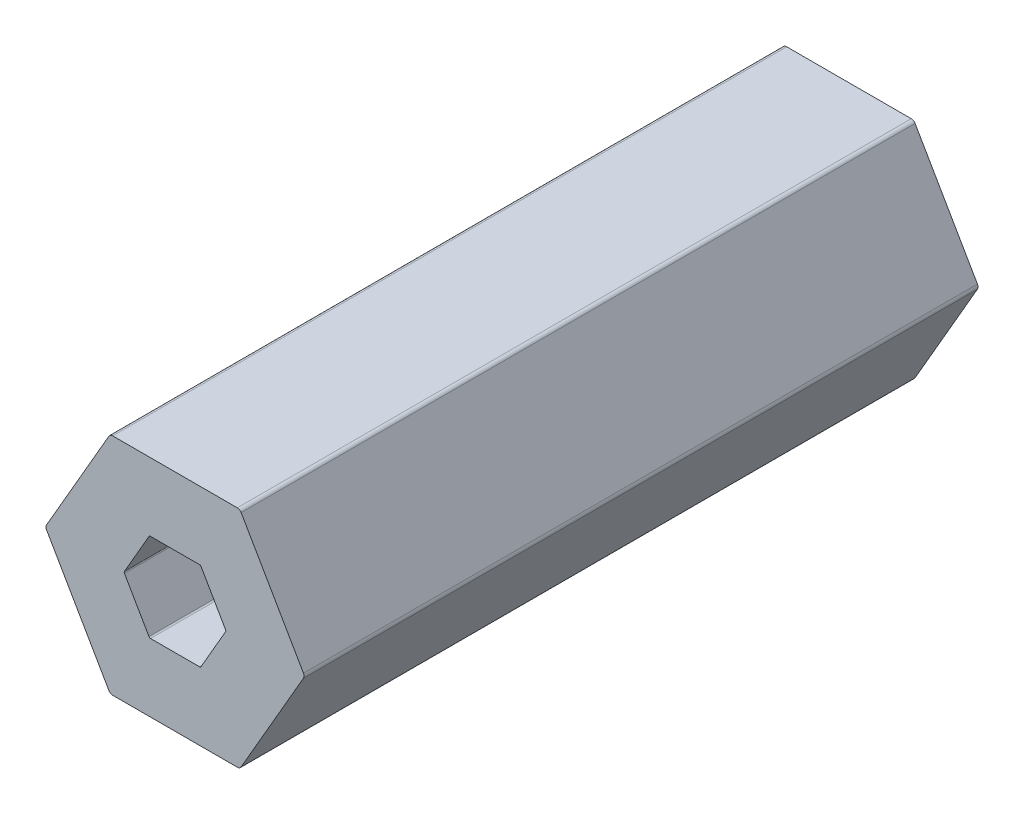
ISO-10303-21;
HEADER;
FILE_DESCRIPTION(('STEP AP214'),'2;1');
FILE_NAME('part.step','',(''),(''),'','','');
FILE_SCHEMA(('AUTOMOTIVE_DESIGN { 1 0 10303 214 1 1 1 1 }'));
ENDSEC;
DATA;
#1=APPLICATION_CONTEXT('core data for automotive mechanical design processes');
#2=APPLICATION_PROTOCOL_DEFINITION('international standard','automotive_design',2000,#1);
#3=PRODUCT_CONTEXT('',#1,'mechanical');
#4=PRODUCT('Part','Part','',(#3));
#5=PRODUCT_RELATED_PRODUCT_CATEGORY('part','',(#4));
#6=PRODUCT_DEFINITION_FORMATION('','',#4);
#7=PRODUCT_DEFINITION_CONTEXT('part definition',#1,'design');
#8=PRODUCT_DEFINITION('design','',#6,#7);
#9=PRODUCT_DEFINITION_SHAPE('','',#8);
#10=(LENGTH_UNIT() NAMED_UNIT(*) SI_UNIT(.MILLI.,.METRE.));
#11=(NAMED_UNIT(*) PLANE_ANGLE_UNIT() SI_UNIT($,.RADIAN.));
#12=(NAMED_UNIT(*) SI_UNIT($,.STERADIAN.) SOLID_ANGLE_UNIT());
#13=UNCERTAINTY_MEASURE_WITH_UNIT(LENGTH_MEASURE(1.E-05),#10,'distance_accuracy_value','');
#14=(GEOMETRIC_REPRESENTATION_CONTEXT(3) GLOBAL_UNCERTAINTY_ASSIGNED_CONTEXT((#13)) GLOBAL_UNIT_ASSIGNED_CONTEXT((#10,
#11,#12)) REPRESENTATION_CONTEXT('',''));
#15=CARTESIAN_POINT('',(0.,0.,0.));
#16=DIRECTION('',(0.,0.,1.));
#17=DIRECTION('',(1.,0.,0.));
#18=AXIS2_PLACEMENT_3D('',#15,#16,#17);
#19=CARTESIAN_POINT('',(2.77128129211021,0.,400.));
#20=DIRECTION('',(0.,0.,1.));
#21=DIRECTION('',(1.,0.,0.));
#22=AXIS2_PLACEMENT_3D('',#19,#20,#21);
#23=CYLINDRICAL_SURFACE('',#22,0.1);
#24=CARTESIAN_POINT('',(2.77128129211021,0.,38.1));
#25=DIRECTION('',(0.,0.,1.));
#26=DIRECTION('',(1.,0.,0.));
#27=AXIS2_PLACEMENT_3D('',#24,#25,#26);
#28=CIRCLE('',#27,0.1);
#29=CARTESIAN_POINT('',(2.85788383248865,0.0500000000000045,38.1));
#30=VERTEX_POINT('',#29);
#31=CARTESIAN_POINT('',(2.8712812921102,0.,38.1));
#32=VERTEX_POINT('',#31);
#33=EDGE_CURVE('E499',#30,#32,#28,.F.);
#34=ORIENTED_EDGE('',*,*,#33,.F.);
#35=DIRECTION('',(0.,0.,1.));
#36=VECTOR('',#35,1.);
#37=CARTESIAN_POINT('',(2.85788383248865,0.0500000000000085,400.));
#38=LINE('',#37,#36);
#39=CARTESIAN_POINT('',(2.85788383248865,0.0500000000000084,0.));
#40=VERTEX_POINT('',#39);
#41=EDGE_CURVE('E340',#40,#30,#38,.T.);
#42=ORIENTED_EDGE('',*,*,#41,.F.);
#43=CARTESIAN_POINT('',(2.77128129211021,0.,0.));
#44=DIRECTION('',(0.,0.,1.));
#45=DIRECTION('',(1.,0.,0.));
#46=AXIS2_PLACEMENT_3D('',#43,#44,#45);
#47=CIRCLE('',#46,0.1);
#48=CARTESIAN_POINT('',(2.8712812921102,0.,0.));
#49=VERTEX_POINT('',#48);
#50=EDGE_CURVE('E372',#49,#40,#47,.T.);
#51=ORIENTED_EDGE('',*,*,#50,.F.);
#52=DIRECTION('',(0.,0.,1.));
#53=VECTOR('',#52,1.);
#54=CARTESIAN_POINT('',(2.8712812921102,0.,400.));
#55=LINE('',#54,#53);
#56=EDGE_CURVE('E46',#49,#32,#55,.T.);
#57=ORIENTED_EDGE('',*,*,#56,.T.);
#58=EDGE_LOOP('',(#34,#42,#51,#57));
#59=FACE_BOUND('',#58,.T.);
#60=ADVANCED_FACE('F38',(#59),#23,.F.);
#61=CARTESIAN_POINT('',(-7.04367328411341,0.,400.));
#62=DIRECTION('',(0.,0.,-1.));
#63=DIRECTION('',(-1.,0.,0.));
#64=AXIS2_PLACEMENT_3D('',#61,#62,#63);
#65=CYLINDRICAL_SURFACE('',#64,0.25);
#66=DIRECTION('',(0.,0.,-1.));
#67=VECTOR('',#66,1.);
#68=CARTESIAN_POINT('',(-7.26017963505952,-0.125000000000051,400.));
#69=LINE('',#68,#67);
#70=CARTESIAN_POINT('',(-7.26017963505952,-0.12500000000005,38.1));
#71=VERTEX_POINT('',#70);
#72=CARTESIAN_POINT('',(-7.26017963505952,-0.12500000000005,0.));
#73=VERTEX_POINT('',#72);
#74=EDGE_CURVE('E396',#71,#73,#69,.T.);
#75=ORIENTED_EDGE('',*,*,#74,.F.);
#76=CARTESIAN_POINT('',(-7.04367328411341,0.,38.1));
#77=DIRECTION('',(0.,0.,1.));
#78=DIRECTION('',(1.,0.,0.));
#79=AXIS2_PLACEMENT_3D('',#76,#77,#78);
#80=CIRCLE('',#79,0.25);
#81=CARTESIAN_POINT('',(-7.29367328411341,0.,38.1));
#82=VERTEX_POINT('',#81);
#83=EDGE_CURVE('E453',#71,#82,#80,.F.);
#84=ORIENTED_EDGE('',*,*,#83,.T.);
#85=DIRECTION('',(0.,0.,-1.));
#86=VECTOR('',#85,1.);
#87=CARTESIAN_POINT('',(-7.29367328411341,0.,400.));
#88=LINE('',#87,#86);
#89=CARTESIAN_POINT('',(-7.29367328411341,0.,0.));
#90=VERTEX_POINT('',#89);
#91=EDGE_CURVE('E344',#82,#90,#88,.T.);
#92=ORIENTED_EDGE('',*,*,#91,.T.);
#93=CARTESIAN_POINT('',(-7.04367328411341,0.,0.));
#94=DIRECTION('',(0.,0.,-1.));
#95=DIRECTION('',(1.,0.,0.));
#96=AXIS2_PLACEMENT_3D('',#93,#94,#95);
#97=CIRCLE('',#96,0.25);
#98=EDGE_CURVE('E269',#73,#90,#97,.T.);
#99=ORIENTED_EDGE('',*,*,#98,.F.);
#100=EDGE_LOOP('',(#75,#84,#92,#99));
#101=FACE_BOUND('',#100,.T.);
#102=ADVANCED_FACE('F587',(#101),#65,.T.);
#103=CARTESIAN_POINT('',(3.66617420935418,-6.34999999999993,400.));
#104=DIRECTION('',(-0.866025403784442,0.5,0.));
#105=DIRECTION('',(0.,0.,1.));
#106=AXIS2_PLACEMENT_3D('',#103,#104,#105);
#107=PLANE('',#106);
#108=DIRECTION('',(0.499999999999999,0.866025403784439,0.));
#109=VECTOR('',#108,1.);
#110=CARTESIAN_POINT('',(3.66617420935418,-6.34999999999993,38.1));
#111=LINE('',#110,#109);
#112=CARTESIAN_POINT('',(3.73834299300289,-6.22499999999993,38.1));
#113=VERTEX_POINT('',#112);
#114=CARTESIAN_POINT('',(7.26017963505952,-0.125,38.1));
#115=VERTEX_POINT('',#114);
#116=EDGE_CURVE('E443',#113,#115,#111,.T.);
#117=ORIENTED_EDGE('',*,*,#116,.F.);
#118=DIRECTION('',(0.,0.,-1.));
#119=VECTOR('',#118,1.);
#120=CARTESIAN_POINT('',(3.73834299300288,-6.22499999999993,400.));
#121=LINE('',#120,#119);
#122=CARTESIAN_POINT('',(3.73834299300288,-6.22499999999993,0.));
#123=VERTEX_POINT('',#122);
#124=EDGE_CURVE('E302',#113,#123,#121,.T.);
#125=ORIENTED_EDGE('',*,*,#124,.T.);
#126=DIRECTION('',(0.5,0.866025403784442,0.));
#127=VECTOR('',#126,1.);
#128=CARTESIAN_POINT('',(3.66617420935418,-6.34999999999993,0.));
#129=LINE('',#128,#127);
#130=CARTESIAN_POINT('',(7.26017963505952,-0.125,0.));
#131=VERTEX_POINT('',#130);
#132=EDGE_CURVE('E304',#123,#131,#129,.T.);
#133=ORIENTED_EDGE('',*,*,#132,.T.);
#134=DIRECTION('',(0.,0.,1.));
#135=VECTOR('',#134,1.);
#136=CARTESIAN_POINT('',(7.26017963505952,-0.125,400.));
#137=LINE('',#136,#135);
#138=EDGE_CURVE('E392',#131,#115,#137,.T.);
#139=ORIENTED_EDGE('',*,*,#138,.T.);
#140=EDGE_LOOP('',(#117,#125,#133,#139));
#141=FACE_BOUND('',#140,.T.);
#142=ADVANCED_FACE('F537',(#141),#107,.F.);
#143=CARTESIAN_POINT('',(7.33234841870822,0.,400.));
#144=DIRECTION('',(-0.866025403784438,-0.5,0.));
#145=DIRECTION('',(-0.5,0.866025403784438,0.));
#146=AXIS2_PLACEMENT_3D('',#143,#144,#145);
#147=PLANE('',#146);
#148=DIRECTION('',(-0.5,0.866025403784438,0.));
#149=VECTOR('',#148,1.);
#150=CARTESIAN_POINT('',(7.33234841870822,0.,38.1));
#151=LINE('',#150,#149);
#152=CARTESIAN_POINT('',(7.26017963505952,0.125,38.1));
#153=VERTEX_POINT('',#152);
#154=CARTESIAN_POINT('',(3.7383429930028,6.225,38.1));
#155=VERTEX_POINT('',#154);
#156=EDGE_CURVE('E53',#153,#155,#151,.T.);
#157=ORIENTED_EDGE('',*,*,#156,.F.);
#158=DIRECTION('',(0.,0.,-1.));
#159=VECTOR('',#158,1.);
#160=CARTESIAN_POINT('',(7.26017963505952,0.125,400.));
#161=LINE('',#160,#159);
#162=CARTESIAN_POINT('',(7.26017963505952,0.125,0.));
#163=VERTEX_POINT('',#162);
#164=EDGE_CURVE('E319',#153,#163,#161,.T.);
#165=ORIENTED_EDGE('',*,*,#164,.T.);
#166=DIRECTION('',(-0.5,0.866025403784438,0.));
#167=VECTOR('',#166,1.);
#168=CARTESIAN_POINT('',(7.33234841870822,0.,0.));
#169=LINE('',#168,#167);
#170=CARTESIAN_POINT('',(3.7383429930028,6.225,0.));
#171=VERTEX_POINT('',#170);
#172=EDGE_CURVE('E316',#163,#171,#169,.T.);
#173=ORIENTED_EDGE('',*,*,#172,.T.);
#174=DIRECTION('',(0.,0.,1.));
#175=VECTOR('',#174,1.);
#176=CARTESIAN_POINT('',(3.7383429930028,6.225,400.));
#177=LINE('',#176,#175);
#178=EDGE_CURVE('E320',#171,#155,#177,.T.);
#179=ORIENTED_EDGE('',*,*,#178,.T.);
#180=EDGE_LOOP('',(#157,#165,#173,#179));
#181=FACE_BOUND('',#180,.T.);
#182=ADVANCED_FACE('F579',(#181),#147,.F.);
#183=CARTESIAN_POINT('',(3.6661742093541,6.35,400.));
#184=DIRECTION('',(0.,-1.,0.));
#185=DIRECTION('',(0.,0.,-1.));
#186=AXIS2_PLACEMENT_3D('',#183,#184,#185);
#187=PLANE('',#186);
#188=DIRECTION('',(-1.,0.,0.));
#189=VECTOR('',#188,1.);
#190=CARTESIAN_POINT('',(3.6661742093541,6.35,38.1));
#191=LINE('',#190,#189);
#192=CARTESIAN_POINT('',(3.52183664205669,6.35,38.1));
#193=VERTEX_POINT('',#192);
#194=CARTESIAN_POINT('',(-3.52183664205674,6.34999999999997,38.1));
#195=VERTEX_POINT('',#194);
#196=EDGE_CURVE('E427',#193,#195,#191,.T.);
#197=ORIENTED_EDGE('',*,*,#196,.F.);
#198=DIRECTION('',(0.,0.,-1.));
#199=VECTOR('',#198,1.);
#200=CARTESIAN_POINT('',(3.52183664205669,6.35,400.));
#201=LINE('',#200,#199);
#202=CARTESIAN_POINT('',(3.52183664205669,6.35,0.));
#203=VERTEX_POINT('',#202);
#204=EDGE_CURVE('E351',#193,#203,#201,.T.);
#205=ORIENTED_EDGE('',*,*,#204,.T.);
#206=DIRECTION('',(-1.,0.,0.));
#207=VECTOR('',#206,1.);
#208=CARTESIAN_POINT('',(3.6661742093541,6.35,0.));
#209=LINE('',#208,#207);
#210=CARTESIAN_POINT('',(-3.52183664205673,6.35,0.));
#211=VERTEX_POINT('',#210);
#212=EDGE_CURVE('E355',#203,#211,#209,.T.);
#213=ORIENTED_EDGE('',*,*,#212,.T.);
#214=DIRECTION('',(0.,0.,1.));
#215=VECTOR('',#214,1.);
#216=CARTESIAN_POINT('',(-3.52183664205673,6.35,400.));
#217=LINE('',#216,#215);
#218=EDGE_CURVE('E358',#211,#195,#217,.T.);
#219=ORIENTED_EDGE('',*,*,#218,.T.);
#220=EDGE_LOOP('',(#197,#205,#213,#219));
#221=FACE_BOUND('',#220,.T.);
#222=ADVANCED_FACE('F572',(#221),#187,.F.);
#223=CARTESIAN_POINT('',(-3.66617420935414,6.35,400.));
#224=DIRECTION('',(0.866025403784442,-0.5,0.));
#225=DIRECTION('',(0.,0.,-1.));
#226=AXIS2_PLACEMENT_3D('',#223,#224,#225);
#227=PLANE('',#226);
#228=DIRECTION('',(-0.499999999999999,-0.866025403784439,0.));
#229=VECTOR('',#228,1.);
#230=CARTESIAN_POINT('',(-3.66617420935414,6.35,38.1));
#231=LINE('',#230,#229);
#232=CARTESIAN_POINT('',(-3.73834299300284,6.225,38.1));
#233=VERTEX_POINT('',#232);
#234=CARTESIAN_POINT('',(-7.26017963505957,0.124999999999951,38.1));
#235=VERTEX_POINT('',#234);
#236=EDGE_CURVE('E441',#233,#235,#231,.T.);
#237=ORIENTED_EDGE('',*,*,#236,.F.);
#238=DIRECTION('',(0.,0.,-1.));
#239=VECTOR('',#238,1.);
#240=CARTESIAN_POINT('',(-3.73834299300284,6.225,400.));
#241=LINE('',#240,#239);
#242=CARTESIAN_POINT('',(-3.73834299300284,6.225,0.));
#243=VERTEX_POINT('',#242);
#244=EDGE_CURVE('E314',#233,#243,#241,.T.);
#245=ORIENTED_EDGE('',*,*,#244,.T.);
#246=DIRECTION('',(-0.5,-0.866025403784442,0.));
#247=VECTOR('',#246,1.);
#248=CARTESIAN_POINT('',(-3.66617420935414,6.35,0.));
#249=LINE('',#248,#247);
#250=CARTESIAN_POINT('',(-7.26017963505952,0.124999999999951,0.));
#251=VERTEX_POINT('',#250);
#252=EDGE_CURVE('E348',#243,#251,#249,.T.);
#253=ORIENTED_EDGE('',*,*,#252,.T.);
#254=DIRECTION('',(0.,0.,1.));
#255=VECTOR('',#254,1.);
#256=CARTESIAN_POINT('',(-7.26017963505952,0.124999999999949,400.));
#257=LINE('',#256,#255);
#258=EDGE_CURVE('E347',#251,#235,#257,.T.);
#259=ORIENTED_EDGE('',*,*,#258,.T.);
#260=EDGE_LOOP('',(#237,#245,#253,#259));
#261=FACE_BOUND('',#260,.T.);
#262=ADVANCED_FACE('F563',(#261),#227,.F.);
#263=CARTESIAN_POINT('',(-7.33234841870822,0.,400.));
#264=DIRECTION('',(0.866025403784435,0.500000000000007,0.));
#265=DIRECTION('',(0.,0.,-1.));
#266=AXIS2_PLACEMENT_3D('',#263,#264,#265);
#267=PLANE('',#266);
#268=DIRECTION('',(0.500000000000007,-0.866025403784435,0.));
#269=VECTOR('',#268,1.);
#270=CARTESIAN_POINT('',(-7.33234841870822,0.,38.1));
#271=LINE('',#270,#269);
#272=CARTESIAN_POINT('',(-3.73834299300275,-6.225,38.1));
#273=VERTEX_POINT('',#272);
#274=EDGE_CURVE('E283',#71,#273,#271,.T.);
#275=ORIENTED_EDGE('',*,*,#274,.F.);
#276=ORIENTED_EDGE('',*,*,#74,.T.);
#277=DIRECTION('',(0.500000000000007,-0.866025403784435,0.));
#278=VECTOR('',#277,1.);
#279=CARTESIAN_POINT('',(-7.33234841870822,0.,0.));
#280=LINE('',#279,#278);
#281=CARTESIAN_POINT('',(-3.73834299300275,-6.225,0.));
#282=VERTEX_POINT('',#281);
#283=EDGE_CURVE('E311',#73,#282,#280,.T.);
#284=ORIENTED_EDGE('',*,*,#283,.T.);
#285=DIRECTION('',(0.,0.,1.));
#286=VECTOR('',#285,1.);
#287=CARTESIAN_POINT('',(-3.73834299300275,-6.225,400.));
#288=LINE('',#287,#286);
#289=EDGE_CURVE('E315',#282,#273,#288,.T.);
#290=ORIENTED_EDGE('',*,*,#289,.T.);
#291=EDGE_LOOP('',(#275,#276,#284,#290));
#292=FACE_BOUND('',#291,.T.);
#293=ADVANCED_FACE('F551',(#292),#267,.F.);
#294=CARTESIAN_POINT('',(-3.66617420935405,-6.35,400.));
#295=DIRECTION('',(0.,1.,0.));
#296=DIRECTION('',(1.,0.,0.));
#297=AXIS2_PLACEMENT_3D('',#294,#295,#296);
#298=PLANE('',#297);
#299=DIRECTION('',(1.,0.,0.));
#300=VECTOR('',#299,1.);
#301=CARTESIAN_POINT('',(-3.66617420935405,-6.35,38.1));
#302=LINE('',#301,#300);
#303=CARTESIAN_POINT('',(-3.52183664205664,-6.35,38.1));
#304=VERTEX_POINT('',#303);
#305=CARTESIAN_POINT('',(3.52183664205678,-6.35,38.1));
#306=VERTEX_POINT('',#305);
#307=EDGE_CURVE('E451',#304,#306,#302,.T.);
#308=ORIENTED_EDGE('',*,*,#307,.F.);
#309=DIRECTION('',(0.,0.,-1.));
#310=VECTOR('',#309,1.);
#311=CARTESIAN_POINT('',(-3.52183664205664,-6.35,400.));
#312=LINE('',#311,#310);
#313=CARTESIAN_POINT('',(-3.52183664205664,-6.35,0.));
#314=VERTEX_POINT('',#313);
#315=EDGE_CURVE('E310',#304,#314,#312,.T.);
#316=ORIENTED_EDGE('',*,*,#315,.T.);
#317=DIRECTION('',(1.,0.,0.));
#318=VECTOR('',#317,1.);
#319=CARTESIAN_POINT('',(-3.66617420935405,-6.35,0.));
#320=LINE('',#319,#318);
#321=CARTESIAN_POINT('',(3.52183664205678,-6.35,0.));
#322=VERTEX_POINT('',#321);
#323=EDGE_CURVE('E309',#314,#322,#320,.T.);
#324=ORIENTED_EDGE('',*,*,#323,.T.);
#325=DIRECTION('',(0.,0.,1.));
#326=VECTOR('',#325,1.);
#327=CARTESIAN_POINT('',(3.52183664205678,-6.35,400.));
#328=LINE('',#327,#326);
#329=EDGE_CURVE('E305',#322,#306,#328,.T.);
#330=ORIENTED_EDGE('',*,*,#329,.T.);
#331=EDGE_LOOP('',(#308,#316,#324,#330));
#332=FACE_BOUND('',#331,.T.);
#333=ADVANCED_FACE('F600',(#332),#298,.F.);
#334=CARTESIAN_POINT('',(1.66837567297407,2.110288568297,400.));
#335=DIRECTION('',(-0.866025403784437,-0.5,0.));
#336=DIRECTION('',(-0.5,0.866025403784437,0.));
#337=AXIS2_PLACEMENT_3D('',#334,#335,#336);
#338=PLANE('',#337);
#339=ORIENTED_EDGE('',*,*,#41,.T.);
#340=DIRECTION('',(-0.500000000000001,0.866025403784438,0.));
#341=VECTOR('',#340,1.);
#342=CARTESIAN_POINT('',(1.66837567297407,2.110288568297,38.1));
#343=LINE('',#342,#341);
#344=CARTESIAN_POINT('',(1.47224318643354,2.45,38.1));
#345=VERTEX_POINT('',#344);
#346=EDGE_CURVE('E503',#30,#345,#343,.T.);
#347=ORIENTED_EDGE('',*,*,#346,.T.);
#348=DIRECTION('',(0.,0.,-1.));
#349=VECTOR('',#348,1.);
#350=CARTESIAN_POINT('',(1.47224318643354,2.45,0.));
#351=LINE('',#350,#349);
#352=CARTESIAN_POINT('',(1.47224318643354,2.45,0.));
#353=VERTEX_POINT('',#352);
#354=EDGE_CURVE('E257',#345,#353,#351,.T.);
#355=ORIENTED_EDGE('',*,*,#354,.T.);
#356=DIRECTION('',(-0.5,0.866025403784437,0.));
#357=VECTOR('',#356,1.);
#358=CARTESIAN_POINT('',(1.66837567297407,2.110288568297,0.));
#359=LINE('',#358,#357);
#360=EDGE_CURVE('E369',#40,#353,#359,.T.);
#361=ORIENTED_EDGE('',*,*,#360,.F.);
#362=EDGE_LOOP('',(#339,#347,#355,#361));
#363=FACE_BOUND('',#362,.T.);
#364=ADVANCED_FACE('F517',(#363),#338,.T.);
#365=CARTESIAN_POINT('',(-0.993375672974064,2.5,400.));
#366=DIRECTION('',(0.,-1.,0.));
#367=DIRECTION('',(0.,0.,-1.));
#368=AXIS2_PLACEMENT_3D('',#365,#366,#367);
#369=PLANE('',#368);
#370=DIRECTION('',(0.,0.,1.));
#371=VECTOR('',#370,1.);
#372=CARTESIAN_POINT('',(1.38564064605509,2.5,400.));
#373=LINE('',#372,#371);
#374=CARTESIAN_POINT('',(1.38564064605509,2.5,0.));
#375=VERTEX_POINT('',#374);
#376=CARTESIAN_POINT('',(1.38564064605509,2.50000000000001,38.1));
#377=VERTEX_POINT('',#376);
#378=EDGE_CURVE('E247',#375,#377,#373,.T.);
#379=ORIENTED_EDGE('',*,*,#378,.T.);
#380=DIRECTION('',(-1.,0.,0.));
#381=VECTOR('',#380,1.);
#382=CARTESIAN_POINT('',(-0.993375672974064,2.5,38.1));
#383=LINE('',#382,#381);
#384=CARTESIAN_POINT('',(-1.38564064605511,2.5,38.1));
#385=VERTEX_POINT('',#384);
#386=EDGE_CURVE('E235',#377,#385,#383,.T.);
#387=ORIENTED_EDGE('',*,*,#386,.T.);
#388=DIRECTION('',(0.,0.,-1.));
#389=VECTOR('',#388,1.);
#390=CARTESIAN_POINT('',(-1.38564064605511,2.5,0.));
#391=LINE('',#390,#389);
#392=CARTESIAN_POINT('',(-1.38564064605511,2.5,0.));
#393=VERTEX_POINT('',#392);
#394=EDGE_CURVE('E244',#385,#393,#391,.T.);
#395=ORIENTED_EDGE('',*,*,#394,.T.);
#396=DIRECTION('',(-1.,0.,0.));
#397=VECTOR('',#396,1.);
#398=CARTESIAN_POINT('',(-0.993375672974064,2.5,0.));
#399=LINE('',#398,#397);
#400=EDGE_CURVE('E354',#375,#393,#399,.T.);
#401=ORIENTED_EDGE('',*,*,#400,.F.);
#402=EDGE_LOOP('',(#379,#387,#395,#401));
#403=FACE_BOUND('',#402,.T.);
#404=ADVANCED_FACE('F243',(#403),#369,.T.);
#405=CARTESIAN_POINT('',(-2.66175134594813,0.389711431702997,400.));
#406=DIRECTION('',(0.86602540378444,-0.5,0.));
#407=DIRECTION('',(0.,0.,-1.));
#408=AXIS2_PLACEMENT_3D('',#405,#406,#407);
#409=PLANE('',#408);
#410=DIRECTION('',(0.,0.,1.));
#411=VECTOR('',#410,1.);
#412=CARTESIAN_POINT('',(-1.47224318643355,2.45,400.));
#413=LINE('',#412,#411);
#414=CARTESIAN_POINT('',(-1.47224318643355,2.45,0.));
#415=VERTEX_POINT('',#414);
#416=CARTESIAN_POINT('',(-1.47224318643355,2.45,38.1));
#417=VERTEX_POINT('',#416);
#418=EDGE_CURVE('E259',#415,#417,#413,.T.);
#419=ORIENTED_EDGE('',*,*,#418,.T.);
#420=DIRECTION('',(-0.499999999999999,-0.866025403784439,0.));
#421=VECTOR('',#420,1.);
#422=CARTESIAN_POINT('',(-2.66175134594813,0.389711431702997,38.1));
#423=LINE('',#422,#421);
#424=CARTESIAN_POINT('',(-2.85788383248865,0.0499999999999911,38.1));
#425=VERTEX_POINT('',#424);
#426=EDGE_CURVE('E60',#417,#425,#423,.T.);
#427=ORIENTED_EDGE('',*,*,#426,.T.);
#428=DIRECTION('',(0.,0.,-1.));
#429=VECTOR('',#428,1.);
#430=CARTESIAN_POINT('',(-2.85788383248865,0.0499999999999911,0.));
#431=LINE('',#430,#429);
#432=CARTESIAN_POINT('',(-2.85788383248865,0.0499999999999911,0.));
#433=VERTEX_POINT('',#432);
#434=EDGE_CURVE('E254',#425,#433,#431,.T.);
#435=ORIENTED_EDGE('',*,*,#434,.T.);
#436=DIRECTION('',(-0.5,-0.86602540378444,0.));
#437=VECTOR('',#436,1.);
#438=CARTESIAN_POINT('',(-2.66175134594813,0.389711431702997,0.));
#439=LINE('',#438,#437);
#440=EDGE_CURVE('E326',#415,#433,#439,.T.);
#441=ORIENTED_EDGE('',*,*,#440,.F.);
#442=EDGE_LOOP('',(#419,#427,#435,#441));
#443=FACE_BOUND('',#442,.T.);
#444=ADVANCED_FACE('F510',(#443),#409,.T.);
#445=CARTESIAN_POINT('',(-1.71837567297406,-2.02368602791856,400.));
#446=DIRECTION('',(0.866025403784437,0.5,0.));
#447=DIRECTION('',(0.,0.,-1.));
#448=AXIS2_PLACEMENT_3D('',#445,#446,#447);
#449=PLANE('',#448);
#450=DIRECTION('',(0.,0.,1.));
#451=VECTOR('',#450,1.);
#452=CARTESIAN_POINT('',(-2.85788383248865,-0.0500000000000092,400.));
#453=LINE('',#452,#451);
#454=CARTESIAN_POINT('',(-2.85788383248865,-0.0500000000000101,0.));
#455=VERTEX_POINT('',#454);
#456=CARTESIAN_POINT('',(-2.85788383248865,-0.0500000000000083,38.1));
#457=VERTEX_POINT('',#456);
#458=EDGE_CURVE('E334',#455,#457,#453,.T.);
#459=ORIENTED_EDGE('',*,*,#458,.T.);
#460=DIRECTION('',(0.500000000000001,-0.866025403784438,0.));
#461=VECTOR('',#460,1.);
#462=CARTESIAN_POINT('',(-1.71837567297406,-2.02368602791856,38.1));
#463=LINE('',#462,#461);
#464=CARTESIAN_POINT('',(-1.47224318643355,-2.45,38.1));
#465=VERTEX_POINT('',#464);
#466=EDGE_CURVE('E491',#457,#465,#463,.T.);
#467=ORIENTED_EDGE('',*,*,#466,.T.);
#468=DIRECTION('',(0.,0.,-1.));
#469=VECTOR('',#468,1.);
#470=CARTESIAN_POINT('',(-1.47224318643354,-2.45,0.));
#471=LINE('',#470,#469);
#472=CARTESIAN_POINT('',(-1.47224318643354,-2.45,0.));
#473=VERTEX_POINT('',#472);
#474=EDGE_CURVE('E400',#465,#473,#471,.T.);
#475=ORIENTED_EDGE('',*,*,#474,.T.);
#476=DIRECTION('',(0.5,-0.866025403784437,0.));
#477=VECTOR('',#476,1.);
#478=CARTESIAN_POINT('',(-1.71837567297406,-2.02368602791856,0.));
#479=LINE('',#478,#477);
#480=EDGE_CURVE('E325',#455,#473,#479,.T.);
#481=ORIENTED_EDGE('',*,*,#480,.F.);
#482=EDGE_LOOP('',(#459,#467,#475,#481));
#483=FACE_BOUND('',#482,.T.);
#484=ADVANCED_FACE('F490',(#483),#449,.T.);
#485=CARTESIAN_POINT('',(0.893375672974065,-2.5,400.));
#486=DIRECTION('',(0.,1.,0.));
#487=DIRECTION('',(1.,0.,0.));
#488=AXIS2_PLACEMENT_3D('',#485,#486,#487);
#489=PLANE('',#488);
#490=DIRECTION('',(0.,0.,1.));
#491=VECTOR('',#490,1.);
#492=CARTESIAN_POINT('',(-1.3856406460551,-2.5,400.));
#493=LINE('',#492,#491);
#494=CARTESIAN_POINT('',(-1.3856406460551,-2.5,0.));
#495=VERTEX_POINT('',#494);
#496=CARTESIAN_POINT('',(-1.3856406460551,-2.5,38.1));
#497=VERTEX_POINT('',#496);
#498=EDGE_CURVE('E281',#495,#497,#493,.T.);
#499=ORIENTED_EDGE('',*,*,#498,.T.);
#500=DIRECTION('',(1.,0.,0.));
#501=VECTOR('',#500,1.);
#502=CARTESIAN_POINT('',(0.893375672974065,-2.5,38.1));
#503=LINE('',#502,#501);
#504=CARTESIAN_POINT('',(1.3856406460551,-2.5,38.1));
#505=VERTEX_POINT('',#504);
#506=EDGE_CURVE('E420',#497,#505,#503,.T.);
#507=ORIENTED_EDGE('',*,*,#506,.T.);
#508=DIRECTION('',(0.,0.,-1.));
#509=VECTOR('',#508,1.);
#510=CARTESIAN_POINT('',(1.3856406460551,-2.5,0.));
#511=LINE('',#510,#509);
#512=CARTESIAN_POINT('',(1.3856406460551,-2.5,0.));
#513=VERTEX_POINT('',#512);
#514=EDGE_CURVE('E273',#505,#513,#511,.T.);
#515=ORIENTED_EDGE('',*,*,#514,.T.);
#516=DIRECTION('',(1.,0.,0.));
#517=VECTOR('',#516,1.);
#518=CARTESIAN_POINT('',(0.893375672974065,-2.5,0.));
#519=LINE('',#518,#517);
#520=EDGE_CURVE('E301',#495,#513,#519,.T.);
#521=ORIENTED_EDGE('',*,*,#520,.F.);
#522=EDGE_LOOP('',(#499,#507,#515,#521));
#523=FACE_BOUND('',#522,.T.);
#524=ADVANCED_FACE('F417',(#523),#489,.T.);
#525=CARTESIAN_POINT('',(1.66837567297407,-2.110288568297,400.));
#526=DIRECTION('',(-0.866025403784439,0.5,0.));
#527=DIRECTION('',(0.,0.,1.));
#528=AXIS2_PLACEMENT_3D('',#525,#526,#527);
#529=PLANE('',#528);
#530=DIRECTION('',(0.,0.,1.));
#531=VECTOR('',#530,1.);
#532=CARTESIAN_POINT('',(1.47224318643355,-2.45,400.));
#533=LINE('',#532,#531);
#534=CARTESIAN_POINT('',(1.47224318643355,-2.45,0.));
#535=VERTEX_POINT('',#534);
#536=CARTESIAN_POINT('',(1.47224318643354,-2.45,38.1));
#537=VERTEX_POINT('',#536);
#538=EDGE_CURVE('E270',#535,#537,#533,.T.);
#539=ORIENTED_EDGE('',*,*,#538,.T.);
#540=DIRECTION('',(0.5,0.866025403784439,0.));
#541=VECTOR('',#540,1.);
#542=CARTESIAN_POINT('',(1.66837567297407,-2.110288568297,38.1));
#543=LINE('',#542,#541);
#544=CARTESIAN_POINT('',(2.85788383248865,-0.0499999999999914,38.1));
#545=VERTEX_POINT('',#544);
#546=EDGE_CURVE('E429',#537,#545,#543,.T.);
#547=ORIENTED_EDGE('',*,*,#546,.T.);
#548=DIRECTION('',(0.,0.,-1.));
#549=VECTOR('',#548,1.);
#550=CARTESIAN_POINT('',(2.85788383248865,-0.0499999999999919,0.));
#551=LINE('',#550,#549);
#552=CARTESIAN_POINT('',(2.85788383248865,-0.0499999999999923,0.));
#553=VERTEX_POINT('',#552);
#554=EDGE_CURVE('E274',#545,#553,#551,.T.);
#555=ORIENTED_EDGE('',*,*,#554,.T.);
#556=DIRECTION('',(0.5,0.866025403784439,0.));
#557=VECTOR('',#556,1.);
#558=CARTESIAN_POINT('',(1.66837567297407,-2.110288568297,0.));
#559=LINE('',#558,#557);
#560=EDGE_CURVE('E263',#535,#553,#559,.T.);
#561=ORIENTED_EDGE('',*,*,#560,.F.);
#562=EDGE_LOOP('',(#539,#547,#555,#561));
#563=FACE_BOUND('',#562,.T.);
#564=ADVANCED_FACE('F611',(#563),#529,.T.);
#565=CARTESIAN_POINT('',(3.52183664205677,-6.1,400.));
#566=DIRECTION('',(0.,0.,-1.));
#567=DIRECTION('',(-1.,0.,0.));
#568=AXIS2_PLACEMENT_3D('',#565,#566,#567);
#569=CYLINDRICAL_SURFACE('',#568,0.25);
#570=ORIENTED_EDGE('',*,*,#124,.F.);
#571=CARTESIAN_POINT('',(3.52183664205677,-6.1,38.1));
#572=DIRECTION('',(0.,0.,1.));
#573=DIRECTION('',(1.,0.,0.));
#574=AXIS2_PLACEMENT_3D('',#571,#572,#573);
#575=CIRCLE('',#574,0.25);
#576=EDGE_CURVE('E448',#113,#306,#575,.F.);
#577=ORIENTED_EDGE('',*,*,#576,.T.);
#578=ORIENTED_EDGE('',*,*,#329,.F.);
#579=CARTESIAN_POINT('',(3.52183664205677,-6.1,0.));
#580=DIRECTION('',(0.,0.,-1.));
#581=DIRECTION('',(1.,0.,0.));
#582=AXIS2_PLACEMENT_3D('',#579,#580,#581);
#583=CIRCLE('',#582,0.25);
#584=EDGE_CURVE('E268',#123,#322,#583,.T.);
#585=ORIENTED_EDGE('',*,*,#584,.F.);
#586=EDGE_LOOP('',(#570,#577,#578,#585));
#587=FACE_BOUND('',#586,.T.);
#588=ADVANCED_FACE('F40',(#587),#569,.T.);
#589=CARTESIAN_POINT('',(-3.52183664205664,-6.1,400.));
#590=DIRECTION('',(0.,0.,-1.));
#591=DIRECTION('',(-1.,0.,0.));
#592=AXIS2_PLACEMENT_3D('',#589,#590,#591);
#593=CYLINDRICAL_SURFACE('',#592,0.25);
#594=ORIENTED_EDGE('',*,*,#315,.F.);
#595=CARTESIAN_POINT('',(-3.52183664205664,-6.1,38.1));
#596=DIRECTION('',(0.,0.,1.));
#597=DIRECTION('',(1.,0.,0.));
#598=AXIS2_PLACEMENT_3D('',#595,#596,#597);
#599=CIRCLE('',#598,0.25);
#600=EDGE_CURVE('E287',#304,#273,#599,.F.);
#601=ORIENTED_EDGE('',*,*,#600,.T.);
#602=ORIENTED_EDGE('',*,*,#289,.F.);
#603=CARTESIAN_POINT('',(-3.52183664205664,-6.1,0.));
#604=DIRECTION('',(0.,0.,-1.));
#605=DIRECTION('',(1.,0.,0.));
#606=AXIS2_PLACEMENT_3D('',#603,#604,#605);
#607=CIRCLE('',#606,0.25);
#608=EDGE_CURVE('E265',#314,#282,#607,.T.);
#609=ORIENTED_EDGE('',*,*,#608,.F.);
#610=EDGE_LOOP('',(#594,#601,#602,#609));
#611=FACE_BOUND('',#610,.T.);
#612=ADVANCED_FACE('F548',(#611),#593,.T.);
#613=CARTESIAN_POINT('',(-7.04367328411341,0.,400.));
#614=DIRECTION('',(0.,0.,-1.));
#615=DIRECTION('',(-1.,0.,0.));
#616=AXIS2_PLACEMENT_3D('',#613,#614,#615);
#617=CYLINDRICAL_SURFACE('',#616,0.25);
#618=ORIENTED_EDGE('',*,*,#91,.F.);
#619=CARTESIAN_POINT('',(-7.04367328411341,0.,38.1));
#620=DIRECTION('',(0.,0.,1.));
#621=DIRECTION('',(1.,0.,0.));
#622=AXIS2_PLACEMENT_3D('',#619,#620,#621);
#623=CIRCLE('',#622,0.25);
#624=EDGE_CURVE('E445',#82,#235,#623,.F.);
#625=ORIENTED_EDGE('',*,*,#624,.T.);
#626=ORIENTED_EDGE('',*,*,#258,.F.);
#627=CARTESIAN_POINT('',(-7.04367328411341,0.,0.));
#628=DIRECTION('',(0.,0.,-1.));
#629=DIRECTION('',(1.,0.,0.));
#630=AXIS2_PLACEMENT_3D('',#627,#628,#629);
#631=CIRCLE('',#630,0.25);
#632=EDGE_CURVE('E293',#90,#251,#631,.T.);
#633=ORIENTED_EDGE('',*,*,#632,.F.);
#634=EDGE_LOOP('',(#618,#625,#626,#633));
#635=FACE_BOUND('',#634,.T.);
#636=ADVANCED_FACE('F560',(#635),#617,.T.);
#637=CARTESIAN_POINT('',(-3.52183664205673,6.1,400.));
#638=DIRECTION('',(0.,0.,-1.));
#639=DIRECTION('',(-1.,0.,0.));
#640=AXIS2_PLACEMENT_3D('',#637,#638,#639);
#641=CYLINDRICAL_SURFACE('',#640,0.25);
#642=ORIENTED_EDGE('',*,*,#244,.F.);
#643=CARTESIAN_POINT('',(-3.52183664205673,6.1,38.1));
#644=DIRECTION('',(0.,0.,1.));
#645=DIRECTION('',(1.,0.,0.));
#646=AXIS2_PLACEMENT_3D('',#643,#644,#645);
#647=CIRCLE('',#646,0.25);
#648=EDGE_CURVE('E438',#233,#195,#647,.F.);
#649=ORIENTED_EDGE('',*,*,#648,.T.);
#650=ORIENTED_EDGE('',*,*,#218,.F.);
#651=CARTESIAN_POINT('',(-3.52183664205673,6.1,0.));
#652=DIRECTION('',(0.,0.,-1.));
#653=DIRECTION('',(1.,0.,0.));
#654=AXIS2_PLACEMENT_3D('',#651,#652,#653);
#655=CIRCLE('',#654,0.25);
#656=EDGE_CURVE('E297',#243,#211,#655,.T.);
#657=ORIENTED_EDGE('',*,*,#656,.F.);
#658=EDGE_LOOP('',(#642,#649,#650,#657));
#659=FACE_BOUND('',#658,.T.);
#660=ADVANCED_FACE('F569',(#659),#641,.T.);
#661=CARTESIAN_POINT('',(7.04367328411341,0.,400.));
#662=DIRECTION('',(0.,0.,-1.));
#663=DIRECTION('',(-1.,0.,0.));
#664=AXIS2_PLACEMENT_3D('',#661,#662,#663);
#665=CYLINDRICAL_SURFACE('',#664,0.25);
#666=ORIENTED_EDGE('',*,*,#164,.F.);
#667=CARTESIAN_POINT('',(7.04367328411341,0.,38.1));
#668=DIRECTION('',(0.,0.,1.));
#669=DIRECTION('',(1.,0.,0.));
#670=AXIS2_PLACEMENT_3D('',#667,#668,#669);
#671=CIRCLE('',#670,0.25);
#672=EDGE_CURVE('E435',#153,#115,#671,.F.);
#673=ORIENTED_EDGE('',*,*,#672,.T.);
#674=ORIENTED_EDGE('',*,*,#138,.F.);
#675=CARTESIAN_POINT('',(7.04367328411341,0.,0.));
#676=DIRECTION('',(0.,0.,-1.));
#677=DIRECTION('',(1.,0.,0.));
#678=AXIS2_PLACEMENT_3D('',#675,#676,#677);
#679=CIRCLE('',#678,0.25);
#680=EDGE_CURVE('E339',#163,#131,#679,.T.);
#681=ORIENTED_EDGE('',*,*,#680,.F.);
#682=EDGE_LOOP('',(#666,#673,#674,#681));
#683=FACE_BOUND('',#682,.T.);
#684=ADVANCED_FACE('F534',(#683),#665,.T.);
#685=CARTESIAN_POINT('',(3.52183664205669,6.1,400.));
#686=DIRECTION('',(0.,0.,-1.));
#687=DIRECTION('',(-1.,0.,0.));
#688=AXIS2_PLACEMENT_3D('',#685,#686,#687);
#689=CYLINDRICAL_SURFACE('',#688,0.25);
#690=ORIENTED_EDGE('',*,*,#204,.F.);
#691=CARTESIAN_POINT('',(3.52183664205669,6.1,38.1));
#692=DIRECTION('',(0.,0.,1.));
#693=DIRECTION('',(1.,0.,0.));
#694=AXIS2_PLACEMENT_3D('',#691,#692,#693);
#695=CIRCLE('',#694,0.25);
#696=EDGE_CURVE('E425',#193,#155,#695,.F.);
#697=ORIENTED_EDGE('',*,*,#696,.T.);
#698=ORIENTED_EDGE('',*,*,#178,.F.);
#699=CARTESIAN_POINT('',(3.52183664205669,6.1,0.));
#700=DIRECTION('',(0.,0.,-1.));
#701=DIRECTION('',(1.,0.,0.));
#702=AXIS2_PLACEMENT_3D('',#699,#700,#701);
#703=CIRCLE('',#702,0.25);
#704=EDGE_CURVE('E335',#203,#171,#703,.T.);
#705=ORIENTED_EDGE('',*,*,#704,.F.);
#706=EDGE_LOOP('',(#690,#697,#698,#705));
#707=FACE_BOUND('',#706,.T.);
#708=ADVANCED_FACE('F577',(#707),#689,.T.);
#709=CARTESIAN_POINT('',(-1.3856406460551,-2.4,400.));
#710=DIRECTION('',(0.,0.,1.));
#711=DIRECTION('',(1.,0.,0.));
#712=AXIS2_PLACEMENT_3D('',#709,#710,#711);
#713=CYLINDRICAL_SURFACE('',#712,0.1);
#714=CARTESIAN_POINT('',(-1.3856406460551,-2.4,38.1));
#715=DIRECTION('',(0.,0.,1.));
#716=DIRECTION('',(1.,0.,0.));
#717=AXIS2_PLACEMENT_3D('',#714,#715,#716);
#718=CIRCLE('',#717,0.1);
#719=EDGE_CURVE('E496',#497,#465,#718,.F.);
#720=ORIENTED_EDGE('',*,*,#719,.F.);
#721=ORIENTED_EDGE('',*,*,#498,.F.);
#722=CARTESIAN_POINT('',(-1.3856406460551,-2.4,0.));
#723=DIRECTION('',(0.,0.,1.));
#724=DIRECTION('',(1.,0.,0.));
#725=AXIS2_PLACEMENT_3D('',#722,#723,#724);
#726=CIRCLE('',#725,0.1);
#727=EDGE_CURVE('E321',#473,#495,#726,.T.);
#728=ORIENTED_EDGE('',*,*,#727,.F.);
#729=ORIENTED_EDGE('',*,*,#474,.F.);
#730=EDGE_LOOP('',(#720,#721,#728,#729));
#731=FACE_BOUND('',#730,.T.);
#732=ADVANCED_FACE('F495',(#731),#713,.F.);
#733=CARTESIAN_POINT('',(-2.77128129211021,0.,400.));
#734=DIRECTION('',(0.,0.,1.));
#735=DIRECTION('',(1.,0.,0.));
#736=AXIS2_PLACEMENT_3D('',#733,#734,#735);
#737=CYLINDRICAL_SURFACE('',#736,0.1);
#738=CARTESIAN_POINT('',(-2.77128129211021,0.,38.1));
#739=DIRECTION('',(0.,0.,1.));
#740=DIRECTION('',(1.,0.,0.));
#741=AXIS2_PLACEMENT_3D('',#738,#739,#740);
#742=CIRCLE('',#741,0.1);
#743=EDGE_CURVE('E487',#457,#425,#742,.F.);
#744=ORIENTED_EDGE('',*,*,#743,.F.);
#745=ORIENTED_EDGE('',*,*,#458,.F.);
#746=CARTESIAN_POINT('',(-2.77128129211021,0.,0.));
#747=DIRECTION('',(0.,0.,1.));
#748=DIRECTION('',(1.,0.,0.));
#749=AXIS2_PLACEMENT_3D('',#746,#747,#748);
#750=CIRCLE('',#749,0.1);
#751=EDGE_CURVE('E329',#433,#455,#750,.T.);
#752=ORIENTED_EDGE('',*,*,#751,.F.);
#753=ORIENTED_EDGE('',*,*,#434,.F.);
#754=EDGE_LOOP('',(#744,#745,#752,#753));
#755=FACE_BOUND('',#754,.T.);
#756=ADVANCED_FACE('F486',(#755),#737,.F.);
#757=CARTESIAN_POINT('',(1.3856406460551,-2.4,400.));
#758=DIRECTION('',(0.,0.,1.));
#759=DIRECTION('',(1.,0.,0.));
#760=AXIS2_PLACEMENT_3D('',#757,#758,#759);
#761=CYLINDRICAL_SURFACE('',#760,0.1);
#762=CARTESIAN_POINT('',(1.3856406460551,-2.4,38.1));
#763=DIRECTION('',(0.,0.,1.));
#764=DIRECTION('',(1.,0.,0.));
#765=AXIS2_PLACEMENT_3D('',#762,#763,#764);
#766=CIRCLE('',#765,0.1);
#767=EDGE_CURVE('E424',#537,#505,#766,.F.);
#768=ORIENTED_EDGE('',*,*,#767,.F.);
#769=ORIENTED_EDGE('',*,*,#538,.F.);
#770=CARTESIAN_POINT('',(1.3856406460551,-2.4,0.));
#771=DIRECTION('',(0.,0.,1.));
#772=DIRECTION('',(1.,0.,0.));
#773=AXIS2_PLACEMENT_3D('',#770,#771,#772);
#774=CIRCLE('',#773,0.1);
#775=EDGE_CURVE('E298',#513,#535,#774,.T.);
#776=ORIENTED_EDGE('',*,*,#775,.F.);
#777=ORIENTED_EDGE('',*,*,#514,.F.);
#778=EDGE_LOOP('',(#768,#769,#776,#777));
#779=FACE_BOUND('',#778,.T.);
#780=ADVANCED_FACE('F423',(#779),#761,.F.);
#781=CARTESIAN_POINT('',(2.77128129211021,0.,400.));
#782=DIRECTION('',(0.,0.,1.));
#783=DIRECTION('',(1.,0.,0.));
#784=AXIS2_PLACEMENT_3D('',#781,#782,#783);
#785=CYLINDRICAL_SURFACE('',#784,0.1);
#786=CARTESIAN_POINT('',(2.77128129211021,0.,38.1));
#787=DIRECTION('',(0.,0.,1.));
#788=DIRECTION('',(1.,0.,0.));
#789=AXIS2_PLACEMENT_3D('',#786,#787,#788);
#790=CIRCLE('',#789,0.1);
#791=EDGE_CURVE('E497',#32,#545,#790,.F.);
#792=ORIENTED_EDGE('',*,*,#791,.F.);
#793=ORIENTED_EDGE('',*,*,#56,.F.);
#794=CARTESIAN_POINT('',(2.77128129211021,0.,0.));
#795=DIRECTION('',(0.,0.,1.));
#796=DIRECTION('',(1.,0.,0.));
#797=AXIS2_PLACEMENT_3D('',#794,#795,#796);
#798=CIRCLE('',#797,0.1);
#799=EDGE_CURVE('E291',#553,#49,#798,.T.);
#800=ORIENTED_EDGE('',*,*,#799,.F.);
#801=ORIENTED_EDGE('',*,*,#554,.F.);
#802=EDGE_LOOP('',(#792,#793,#800,#801));
#803=FACE_BOUND('',#802,.T.);
#804=ADVANCED_FACE('F522',(#803),#785,.F.);
#805=CARTESIAN_POINT('',(1.3856406460551,2.4,400.));
#806=DIRECTION('',(0.,0.,1.));
#807=DIRECTION('',(1.,0.,0.));
#808=AXIS2_PLACEMENT_3D('',#805,#806,#807);
#809=CYLINDRICAL_SURFACE('',#808,0.1);
#810=CARTESIAN_POINT('',(1.3856406460551,2.4,38.1));
#811=DIRECTION('',(0.,0.,1.));
#812=DIRECTION('',(1.,0.,0.));
#813=AXIS2_PLACEMENT_3D('',#810,#811,#812);
#814=CIRCLE('',#813,0.1);
#815=EDGE_CURVE('E248',#377,#345,#814,.F.);
#816=ORIENTED_EDGE('',*,*,#815,.F.);
#817=ORIENTED_EDGE('',*,*,#378,.F.);
#818=CARTESIAN_POINT('',(1.3856406460551,2.4,0.));
#819=DIRECTION('',(0.,0.,1.));
#820=DIRECTION('',(1.,0.,0.));
#821=AXIS2_PLACEMENT_3D('',#818,#819,#820);
#822=CIRCLE('',#821,0.1);
#823=EDGE_CURVE('E365',#353,#375,#822,.T.);
#824=ORIENTED_EDGE('',*,*,#823,.F.);
#825=ORIENTED_EDGE('',*,*,#354,.F.);
#826=EDGE_LOOP('',(#816,#817,#824,#825));
#827=FACE_BOUND('',#826,.T.);
#828=ADVANCED_FACE('F514',(#827),#809,.F.);
#829=CARTESIAN_POINT('',(-1.38564064605511,2.4,400.));
#830=DIRECTION('',(0.,0.,1.));
#831=DIRECTION('',(1.,0.,0.));
#832=AXIS2_PLACEMENT_3D('',#829,#830,#831);
#833=CYLINDRICAL_SURFACE('',#832,0.1);
#834=CARTESIAN_POINT('',(-1.38564064605511,2.4,38.1));
#835=DIRECTION('',(0.,0.,1.));
#836=DIRECTION('',(1.,0.,0.));
#837=AXIS2_PLACEMENT_3D('',#834,#835,#836);
#838=CIRCLE('',#837,0.1);
#839=EDGE_CURVE('E11',#417,#385,#838,.F.);
#840=ORIENTED_EDGE('',*,*,#839,.F.);
#841=ORIENTED_EDGE('',*,*,#418,.F.);
#842=CARTESIAN_POINT('',(-1.38564064605511,2.4,0.));
#843=DIRECTION('',(0.,0.,1.));
#844=DIRECTION('',(1.,0.,0.));
#845=AXIS2_PLACEMENT_3D('',#842,#843,#844);
#846=CIRCLE('',#845,0.1);
#847=EDGE_CURVE('E252',#393,#415,#846,.T.);
#848=ORIENTED_EDGE('',*,*,#847,.F.);
#849=ORIENTED_EDGE('',*,*,#394,.F.);
#850=EDGE_LOOP('',(#840,#841,#848,#849));
#851=FACE_BOUND('',#850,.T.);
#852=ADVANCED_FACE('F250',(#851),#833,.F.);
#853=CARTESIAN_POINT('',(0.,0.,0.));
#854=DIRECTION('',(0.,0.,1.));
#855=DIRECTION('',(1.,0.,0.));
#856=AXIS2_PLACEMENT_3D('',#853,#854,#855);
#857=PLANE('',#856);
#858=ORIENTED_EDGE('',*,*,#132,.F.);
#859=ORIENTED_EDGE('',*,*,#584,.T.);
#860=ORIENTED_EDGE('',*,*,#323,.F.);
#861=ORIENTED_EDGE('',*,*,#608,.T.);
#862=ORIENTED_EDGE('',*,*,#283,.F.);
#863=ORIENTED_EDGE('',*,*,#98,.T.);
#864=ORIENTED_EDGE('',*,*,#632,.T.);
#865=ORIENTED_EDGE('',*,*,#252,.F.);
#866=ORIENTED_EDGE('',*,*,#656,.T.);
#867=ORIENTED_EDGE('',*,*,#212,.F.);
#868=ORIENTED_EDGE('',*,*,#704,.T.);
#869=ORIENTED_EDGE('',*,*,#172,.F.);
#870=ORIENTED_EDGE('',*,*,#680,.T.);
#871=EDGE_LOOP('',(#858,#859,#860,#861,#862,#863,#864,#865,#866,#867,#868,#869,#870));
#872=FACE_BOUND('',#871,.T.);
#873=ORIENTED_EDGE('',*,*,#560,.T.);
#874=ORIENTED_EDGE('',*,*,#799,.T.);
#875=ORIENTED_EDGE('',*,*,#50,.T.);
#876=ORIENTED_EDGE('',*,*,#360,.T.);
#877=ORIENTED_EDGE('',*,*,#823,.T.);
#878=ORIENTED_EDGE('',*,*,#400,.T.);
#879=ORIENTED_EDGE('',*,*,#847,.T.);
#880=ORIENTED_EDGE('',*,*,#440,.T.);
#881=ORIENTED_EDGE('',*,*,#751,.T.);
#882=ORIENTED_EDGE('',*,*,#480,.T.);
#883=ORIENTED_EDGE('',*,*,#727,.T.);
#884=ORIENTED_EDGE('',*,*,#520,.T.);
#885=ORIENTED_EDGE('',*,*,#775,.T.);
#886=EDGE_LOOP('',(#873,#874,#875,#876,#877,#878,#879,#880,#881,#882,#883,#884,#885));
#887=FACE_BOUND('',#886,.T.);
#888=ADVANCED_FACE('F412',(#872,#887),#857,.F.);
#889=CARTESIAN_POINT('',(0.,0.,38.1));
#890=DIRECTION('',(0.,0.,1.));
#891=DIRECTION('',(1.,0.,0.));
#892=AXIS2_PLACEMENT_3D('',#889,#890,#891);
#893=PLANE('',#892);
#894=ORIENTED_EDGE('',*,*,#767,.T.);
#895=ORIENTED_EDGE('',*,*,#506,.F.);
#896=ORIENTED_EDGE('',*,*,#719,.T.);
#897=ORIENTED_EDGE('',*,*,#466,.F.);
#898=ORIENTED_EDGE('',*,*,#743,.T.);
#899=ORIENTED_EDGE('',*,*,#426,.F.);
#900=ORIENTED_EDGE('',*,*,#839,.T.);
#901=ORIENTED_EDGE('',*,*,#386,.F.);
#902=ORIENTED_EDGE('',*,*,#815,.T.);
#903=ORIENTED_EDGE('',*,*,#346,.F.);
#904=ORIENTED_EDGE('',*,*,#33,.T.);
#905=ORIENTED_EDGE('',*,*,#791,.T.);
#906=ORIENTED_EDGE('',*,*,#546,.F.);
#907=EDGE_LOOP('',(#894,#895,#896,#897,#898,#899,#900,#901,#902,#903,#904,#905,#906));
#908=FACE_BOUND('',#907,.T.);
#909=ORIENTED_EDGE('',*,*,#274,.T.);
#910=ORIENTED_EDGE('',*,*,#600,.F.);
#911=ORIENTED_EDGE('',*,*,#307,.T.);
#912=ORIENTED_EDGE('',*,*,#576,.F.);
#913=ORIENTED_EDGE('',*,*,#116,.T.);
#914=ORIENTED_EDGE('',*,*,#672,.F.);
#915=ORIENTED_EDGE('',*,*,#156,.T.);
#916=ORIENTED_EDGE('',*,*,#696,.F.);
#917=ORIENTED_EDGE('',*,*,#196,.T.);
#918=ORIENTED_EDGE('',*,*,#648,.F.);
#919=ORIENTED_EDGE('',*,*,#236,.T.);
#920=ORIENTED_EDGE('',*,*,#624,.F.);
#921=ORIENTED_EDGE('',*,*,#83,.F.);
#922=EDGE_LOOP('',(#909,#910,#911,#912,#913,#914,#915,#916,#917,#918,#919,#920,#921));
#923=FACE_BOUND('',#922,.T.);
#924=ADVANCED_FACE('F234',(#908,#923),#893,.T.);
#925=CLOSED_SHELL('',(#60,#102,#142,#182,#222,#262,#293,#333,#364,#404,#444,#484,#524,#564,#588,
#612,#636,#660,#684,#708,#732,#756,#780,#804,#828,#852,#888,#924));
#926=MANIFOLD_SOLID_BREP('B2',#925);
#927=ADVANCED_BREP_SHAPE_REPRESENTATION('',(#18,#926),#14);
#928=SHAPE_DEFINITION_REPRESENTATION(#9,#927);
ENDSEC;
END-ISO-10303-21;
